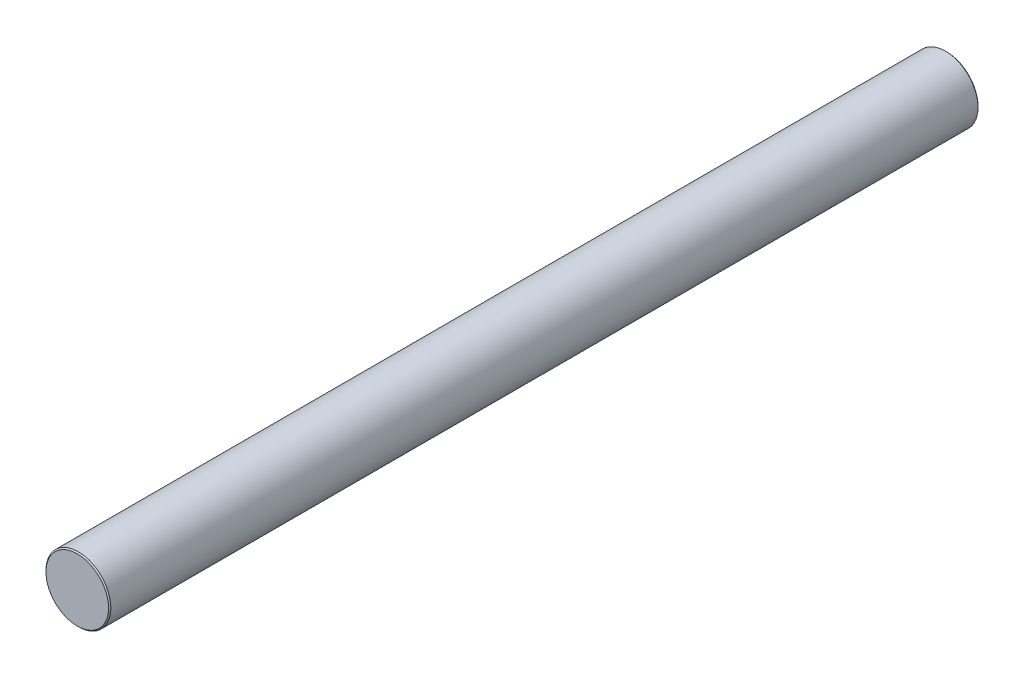
ISO-10303-21;
HEADER;
FILE_DESCRIPTION(('STEP AP214'),'2;1');
FILE_NAME('part.step','',(''),(''),'','','');
FILE_SCHEMA(('AUTOMOTIVE_DESIGN { 1 0 10303 214 1 1 1 1 }'));
ENDSEC;
DATA;
#1=APPLICATION_CONTEXT('core data for automotive mechanical design processes');
#2=APPLICATION_PROTOCOL_DEFINITION('international standard','automotive_design',2000,#1);
#3=PRODUCT_CONTEXT('',#1,'mechanical');
#4=PRODUCT('Part','Part','',(#3));
#5=PRODUCT_RELATED_PRODUCT_CATEGORY('part','',(#4));
#6=PRODUCT_DEFINITION_FORMATION('','',#4);
#7=PRODUCT_DEFINITION_CONTEXT('part definition',#1,'design');
#8=PRODUCT_DEFINITION('design','',#6,#7);
#9=PRODUCT_DEFINITION_SHAPE('','',#8);
#10=(LENGTH_UNIT() NAMED_UNIT(*) SI_UNIT(.MILLI.,.METRE.));
#11=(NAMED_UNIT(*) PLANE_ANGLE_UNIT() SI_UNIT($,.RADIAN.));
#12=(NAMED_UNIT(*) SI_UNIT($,.STERADIAN.) SOLID_ANGLE_UNIT());
#13=UNCERTAINTY_MEASURE_WITH_UNIT(LENGTH_MEASURE(1.E-05),#10,'distance_accuracy_value','');
#14=(GEOMETRIC_REPRESENTATION_CONTEXT(3) GLOBAL_UNCERTAINTY_ASSIGNED_CONTEXT((#13)) GLOBAL_UNIT_ASSIGNED_CONTEXT((#10,
#11,#12)) REPRESENTATION_CONTEXT('',''));
#15=CARTESIAN_POINT('',(0.,0.,0.));
#16=DIRECTION('',(0.,0.,1.));
#17=DIRECTION('',(1.,0.,0.));
#18=AXIS2_PLACEMENT_3D('',#15,#16,#17);
#19=CARTESIAN_POINT('',(0.,0.,374.999999999998));
#20=DIRECTION('',(0.,0.,-0.999999999999996));
#21=DIRECTION('',(-1.,0.,0.));
#22=AXIS2_PLACEMENT_3D('',#19,#20,#21);
#23=CYLINDRICAL_SURFACE('',#22,28.);
#24=CARTESIAN_POINT('',(0.,0.,-373.999999999998));
#25=DIRECTION('',(0.,0.,0.999999999999996));
#26=DIRECTION('',(1.,0.,0.));
#27=AXIS2_PLACEMENT_3D('',#24,#25,#26);
#28=CIRCLE('',#27,28.);
#29=CARTESIAN_POINT('',(28.,0.,-373.999999999998));
#30=VERTEX_POINT('',#29);
#31=EDGE_CURVE('E51',#30,#30,#28,.T.);
#32=ORIENTED_EDGE('',*,*,#31,.T.);
#33=EDGE_LOOP('',(#32));
#34=FACE_BOUND('',#33,.T.);
#35=CARTESIAN_POINT('',(0.,0.,373.999999999998));
#36=DIRECTION('',(0.,0.,0.999999999999996));
#37=DIRECTION('',(1.,0.,0.));
#38=AXIS2_PLACEMENT_3D('',#35,#36,#37);
#39=CIRCLE('',#38,28.);
#40=CARTESIAN_POINT('',(28.,0.,373.999999999998));
#41=VERTEX_POINT('',#40);
#42=EDGE_CURVE('E57',#41,#41,#39,.F.);
#43=ORIENTED_EDGE('',*,*,#42,.T.);
#44=EDGE_LOOP('',(#43));
#45=FACE_BOUND('',#44,.T.);
#46=ADVANCED_FACE('F36',(#34,#45),#23,.T.);
#47=CARTESIAN_POINT('',(0.,0.,374.999999999998));
#48=DIRECTION('',(0.,0.,0.999999999999996));
#49=DIRECTION('',(1.,0.,0.));
#50=AXIS2_PLACEMENT_3D('',#47,#48,#49);
#51=PLANE('',#50);
#52=CARTESIAN_POINT('',(0.,0.,374.999999999998));
#53=DIRECTION('',(0.,0.,0.999999999999996));
#54=DIRECTION('',(1.,0.,0.));
#55=AXIS2_PLACEMENT_3D('',#52,#53,#54);
#56=CIRCLE('',#55,27.0000000000001);
#57=CARTESIAN_POINT('',(27.0000000000001,0.,374.999999999998));
#58=VERTEX_POINT('',#57);
#59=EDGE_CURVE('E10',#58,#58,#56,.T.);
#60=ORIENTED_EDGE('',*,*,#59,.T.);
#61=EDGE_LOOP('',(#60));
#62=FACE_BOUND('',#61,.T.);
#63=ADVANCED_FACE('F75',(#62),#51,.T.);
#64=CARTESIAN_POINT('',(0.,0.,-374.999999999998));
#65=DIRECTION('',(0.,0.,0.999999999999996));
#66=DIRECTION('',(1.,0.,0.));
#67=AXIS2_PLACEMENT_3D('',#64,#65,#66);
#68=PLANE('',#67);
#69=CARTESIAN_POINT('',(0.,0.,-374.999999999998));
#70=DIRECTION('',(0.,0.,0.999999999999996));
#71=DIRECTION('',(1.,0.,0.));
#72=AXIS2_PLACEMENT_3D('',#69,#70,#71);
#73=CIRCLE('',#72,27.);
#74=CARTESIAN_POINT('',(27.,0.,-374.999999999998));
#75=VERTEX_POINT('',#74);
#76=EDGE_CURVE('E44',#75,#75,#73,.F.);
#77=ORIENTED_EDGE('',*,*,#76,.T.);
#78=EDGE_LOOP('',(#77));
#79=FACE_BOUND('',#78,.T.);
#80=ADVANCED_FACE('F72',(#79),#68,.F.);
#81=CARTESIAN_POINT('',(0.,0.,-373.999999999998));
#82=DIRECTION('',(0.,0.,0.999999999999996));
#83=DIRECTION('',(1.,0.,0.));
#84=AXIS2_PLACEMENT_3D('',#81,#82,#83);
#85=CONICAL_SURFACE('',#84,28.,0.785398163397381);
#86=ORIENTED_EDGE('',*,*,#76,.F.);
#87=EDGE_LOOP('',(#86));
#88=FACE_BOUND('',#87,.T.);
#89=ORIENTED_EDGE('',*,*,#31,.F.);
#90=EDGE_LOOP('',(#89));
#91=FACE_BOUND('',#90,.T.);
#92=ADVANCED_FACE('F68',(#88,#91),#85,.T.);
#93=CARTESIAN_POINT('',(0.,0.,374.999999999998));
#94=DIRECTION('',(0.,0.,-0.999999999999996));
#95=DIRECTION('',(-1.,0.,0.));
#96=AXIS2_PLACEMENT_3D('',#93,#94,#95);
#97=CONICAL_SURFACE('',#96,27.0000000000001,0.785398163397408);
#98=ORIENTED_EDGE('',*,*,#42,.F.);
#99=EDGE_LOOP('',(#98));
#100=FACE_BOUND('',#99,.T.);
#101=ORIENTED_EDGE('',*,*,#59,.F.);
#102=EDGE_LOOP('',(#101));
#103=FACE_BOUND('',#102,.T.);
#104=ADVANCED_FACE('F38',(#100,#103),#97,.T.);
#105=CLOSED_SHELL('',(#46,#63,#80,#92,#104));
#106=MANIFOLD_SOLID_BREP('B2',#105);
#107=ADVANCED_BREP_SHAPE_REPRESENTATION('',(#18,#106),#14);
#108=SHAPE_DEFINITION_REPRESENTATION(#9,#107);
ENDSEC;
END-ISO-10303-21;
